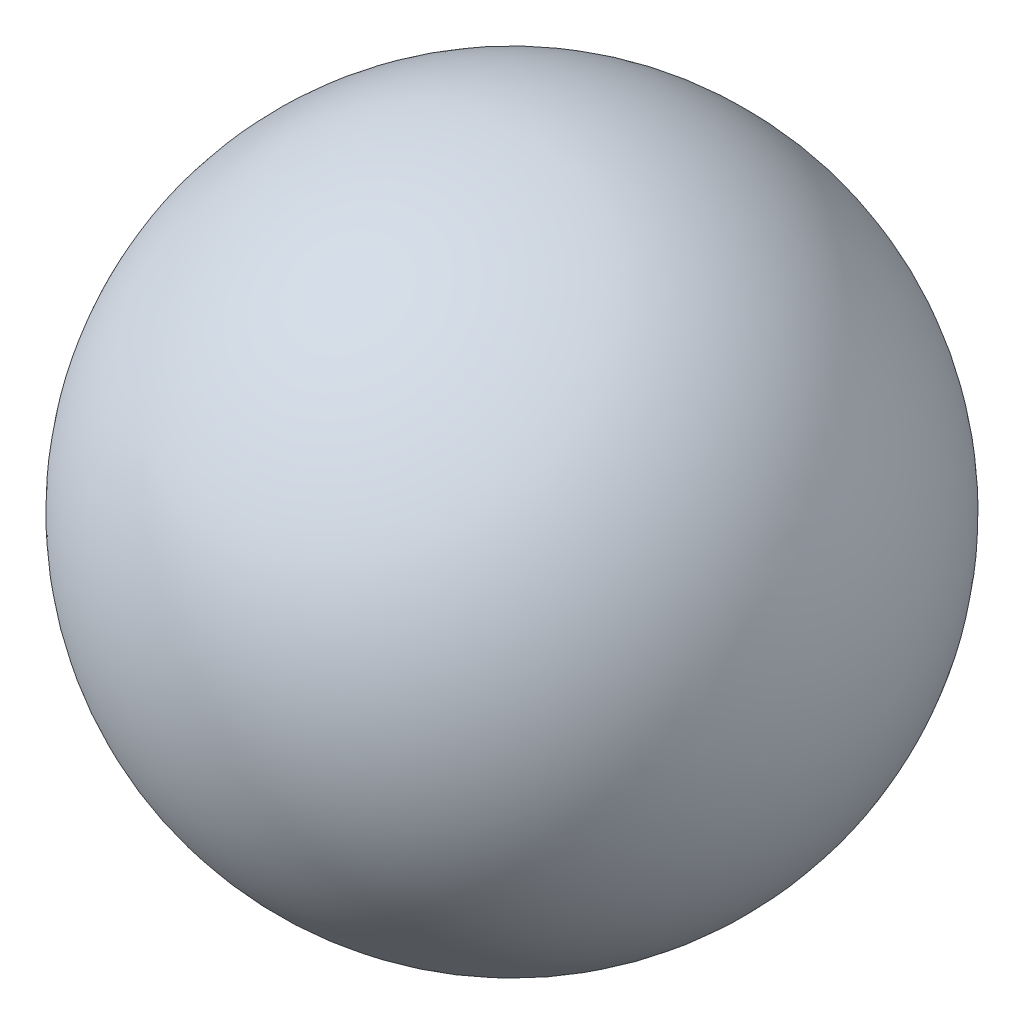
ISO-10303-21;
HEADER;
FILE_DESCRIPTION(('STEP AP214'),'2;1');
FILE_NAME('part.step','',(''),(''),'','','');
FILE_SCHEMA(('AUTOMOTIVE_DESIGN { 1 0 10303 214 1 1 1 1 }'));
ENDSEC;
DATA;
#1=APPLICATION_CONTEXT('core data for automotive mechanical design processes');
#2=APPLICATION_PROTOCOL_DEFINITION('international standard','automotive_design',2000,#1);
#3=PRODUCT_CONTEXT('',#1,'mechanical');
#4=PRODUCT('Part','Part','',(#3));
#5=PRODUCT_RELATED_PRODUCT_CATEGORY('part','',(#4));
#6=PRODUCT_DEFINITION_FORMATION('','',#4);
#7=PRODUCT_DEFINITION_CONTEXT('part definition',#1,'design');
#8=PRODUCT_DEFINITION('design','',#6,#7);
#9=PRODUCT_DEFINITION_SHAPE('','',#8);
#10=(LENGTH_UNIT() NAMED_UNIT(*) SI_UNIT(.MILLI.,.METRE.));
#11=(NAMED_UNIT(*) PLANE_ANGLE_UNIT() SI_UNIT($,.RADIAN.));
#12=(NAMED_UNIT(*) SI_UNIT($,.STERADIAN.) SOLID_ANGLE_UNIT());
#13=UNCERTAINTY_MEASURE_WITH_UNIT(LENGTH_MEASURE(1.E-05),#10,'distance_accuracy_value','');
#14=(GEOMETRIC_REPRESENTATION_CONTEXT(3) GLOBAL_UNCERTAINTY_ASSIGNED_CONTEXT((#13)) GLOBAL_UNIT_ASSIGNED_CONTEXT((#10,
#11,#12)) REPRESENTATION_CONTEXT('',''));
#15=CARTESIAN_POINT('',(0.,0.,0.));
#16=DIRECTION('',(0.,0.,1.));
#17=DIRECTION('',(1.,0.,0.));
#18=AXIS2_PLACEMENT_3D('',#15,#16,#17);
#19=CARTESIAN_POINT('',(0.,16.75,0.));
#20=DIRECTION('',(-1.,0.,0.));
#21=DIRECTION('',(0.,1.,0.));
#22=AXIS2_PLACEMENT_3D('',#19,#20,#21);
#23=SPHERICAL_SURFACE('',#22,3.969);
#24=CARTESIAN_POINT('',(-3.969,16.75,0.));
#25=VERTEX_POINT('',#24);
#26=VERTEX_LOOP('',#25);
#27=FACE_BOUND('',#26,.T.);
#28=ADVANCED_FACE('F33',(#27),#23,.T.);
#29=CLOSED_SHELL('',(#28));
#30=MANIFOLD_SOLID_BREP('B2',#29);
#31=ADVANCED_BREP_SHAPE_REPRESENTATION('',(#18,#30),#14);
#32=SHAPE_DEFINITION_REPRESENTATION(#9,#31);
ENDSEC;
END-ISO-10303-21;
